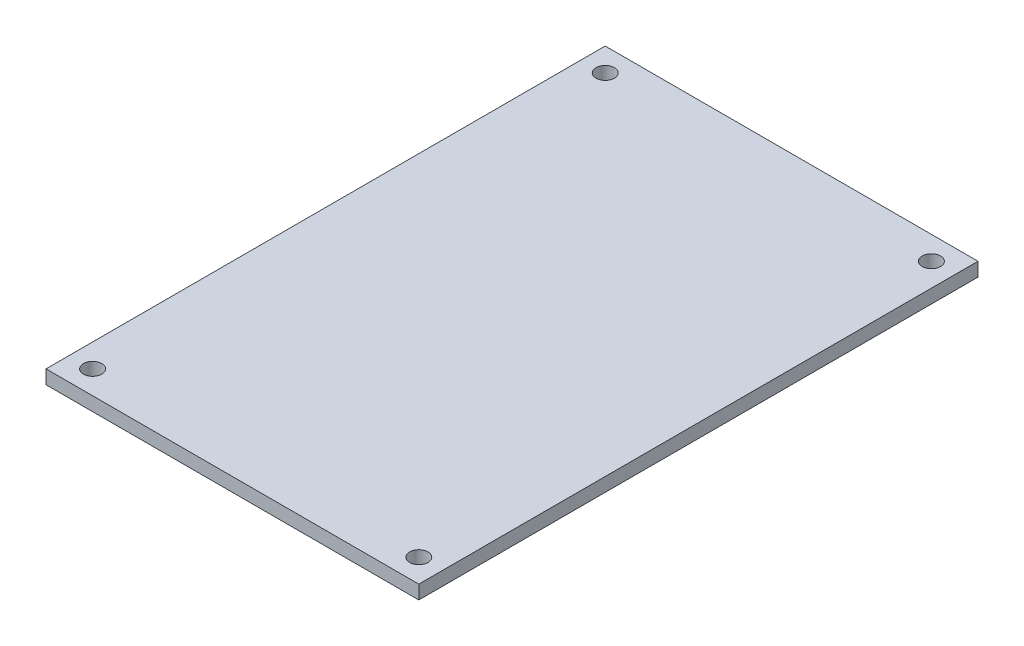
ISO-10303-21;
HEADER;
FILE_DESCRIPTION(('STEP AP214'),'2;1');
FILE_NAME('part.step','',(''),(''),'','','');
FILE_SCHEMA(('AUTOMOTIVE_DESIGN { 1 0 10303 214 1 1 1 1 }'));
ENDSEC;
DATA;
#1=APPLICATION_CONTEXT('core data for automotive mechanical design processes');
#2=APPLICATION_PROTOCOL_DEFINITION('international standard','automotive_design',2000,#1);
#3=PRODUCT_CONTEXT('',#1,'mechanical');
#4=PRODUCT('Part','Part','',(#3));
#5=PRODUCT_RELATED_PRODUCT_CATEGORY('part','',(#4));
#6=PRODUCT_DEFINITION_FORMATION('','',#4);
#7=PRODUCT_DEFINITION_CONTEXT('part definition',#1,'design');
#8=PRODUCT_DEFINITION('design','',#6,#7);
#9=PRODUCT_DEFINITION_SHAPE('','',#8);
#10=(LENGTH_UNIT() NAMED_UNIT(*) SI_UNIT(.MILLI.,.METRE.));
#11=(NAMED_UNIT(*) PLANE_ANGLE_UNIT() SI_UNIT($,.RADIAN.));
#12=(NAMED_UNIT(*) SI_UNIT($,.STERADIAN.) SOLID_ANGLE_UNIT());
#13=UNCERTAINTY_MEASURE_WITH_UNIT(LENGTH_MEASURE(1.E-05),#10,'distance_accuracy_value','');
#14=(GEOMETRIC_REPRESENTATION_CONTEXT(3) GLOBAL_UNCERTAINTY_ASSIGNED_CONTEXT((#13)) GLOBAL_UNIT_ASSIGNED_CONTEXT((#10,
#11,#12)) REPRESENTATION_CONTEXT('',''));
#15=CARTESIAN_POINT('',(0.,0.,0.));
#16=DIRECTION('',(0.,0.,1.));
#17=DIRECTION('',(1.,0.,0.));
#18=AXIS2_PLACEMENT_3D('',#15,#16,#17);
#19=CARTESIAN_POINT('',(0.,0.,0.));
#20=DIRECTION('',(0.,1.,0.));
#21=DIRECTION('',(0.,0.,1.));
#22=AXIS2_PLACEMENT_3D('',#19,#20,#21);
#23=PLANE('',#22);
#24=CARTESIAN_POINT('',(38.1,0.,-50.8));
#25=DIRECTION('',(0.,1.,0.));
#26=DIRECTION('',(0.,0.,1.));
#27=AXIS2_PLACEMENT_3D('',#24,#25,#26);
#28=CIRCLE('',#27,0.499999999999999);
#29=CARTESIAN_POINT('',(38.1,0.,-50.3));
#30=VERTEX_POINT('',#29);
#31=EDGE_CURVE('E207',#30,#30,#28,.T.);
#32=ORIENTED_EDGE('',*,*,#31,.T.);
#33=EDGE_LOOP('',(#32));
#34=FACE_BOUND('',#33,.T.);
#35=CARTESIAN_POINT('',(2.54,0.,-50.8));
#36=DIRECTION('',(0.,1.,0.));
#37=DIRECTION('',(0.,0.,1.));
#38=AXIS2_PLACEMENT_3D('',#35,#36,#37);
#39=CIRCLE('',#38,0.5);
#40=CARTESIAN_POINT('',(2.54,0.,-50.3));
#41=VERTEX_POINT('',#40);
#42=EDGE_CURVE('E130',#41,#41,#39,.F.);
#43=ORIENTED_EDGE('',*,*,#42,.F.);
#44=EDGE_LOOP('',(#43));
#45=FACE_BOUND('',#44,.T.);
#46=CARTESIAN_POINT('',(38.1,0.,-58.42));
#47=DIRECTION('',(0.,1.,0.));
#48=DIRECTION('',(0.,0.,1.));
#49=AXIS2_PLACEMENT_3D('',#46,#47,#48);
#50=CIRCLE('',#49,0.999999999999998);
#51=CARTESIAN_POINT('',(38.1,0.,-57.42));
#52=VERTEX_POINT('',#51);
#53=EDGE_CURVE('E97',#52,#52,#50,.T.);
#54=ORIENTED_EDGE('',*,*,#53,.T.);
#55=EDGE_LOOP('',(#54));
#56=FACE_BOUND('',#55,.T.);
#57=CARTESIAN_POINT('',(38.1,0.,-2.54));
#58=DIRECTION('',(0.,1.,0.));
#59=DIRECTION('',(0.,0.,1.));
#60=AXIS2_PLACEMENT_3D('',#57,#58,#59);
#61=CIRCLE('',#60,0.999999999999998);
#62=CARTESIAN_POINT('',(38.1,0.,-1.54));
#63=VERTEX_POINT('',#62);
#64=EDGE_CURVE('E100',#63,#63,#61,.F.);
#65=ORIENTED_EDGE('',*,*,#64,.F.);
#66=EDGE_LOOP('',(#65));
#67=FACE_BOUND('',#66,.T.);
#68=CARTESIAN_POINT('',(2.54,0.,-58.42));
#69=DIRECTION('',(0.,1.,0.));
#70=DIRECTION('',(0.,0.,1.));
#71=AXIS2_PLACEMENT_3D('',#68,#69,#70);
#72=CIRCLE('',#71,0.999999999999999);
#73=CARTESIAN_POINT('',(2.54,0.,-57.42));
#74=VERTEX_POINT('',#73);
#75=EDGE_CURVE('E104',#74,#74,#72,.F.);
#76=ORIENTED_EDGE('',*,*,#75,.F.);
#77=EDGE_LOOP('',(#76));
#78=FACE_BOUND('',#77,.T.);
#79=CARTESIAN_POINT('',(2.54,0.,-2.54));
#80=DIRECTION('',(0.,1.,0.));
#81=DIRECTION('',(0.,0.,1.));
#82=AXIS2_PLACEMENT_3D('',#79,#80,#81);
#83=CIRCLE('',#82,0.999999999999998);
#84=CARTESIAN_POINT('',(2.54,0.,-1.54));
#85=VERTEX_POINT('',#84);
#86=EDGE_CURVE('E107',#85,#85,#83,.T.);
#87=ORIENTED_EDGE('',*,*,#86,.T.);
#88=EDGE_LOOP('',(#87));
#89=FACE_BOUND('',#88,.T.);
#90=DIRECTION('',(1.,0.,0.));
#91=VECTOR('',#90,1.);
#92=CARTESIAN_POINT('',(0.,0.,0.));
#93=LINE('',#92,#91);
#94=CARTESIAN_POINT('',(0.,0.,0.));
#95=VERTEX_POINT('',#94);
#96=CARTESIAN_POINT('',(40.64,0.,0.));
#97=VERTEX_POINT('',#96);
#98=EDGE_CURVE('E110',#95,#97,#93,.T.);
#99=ORIENTED_EDGE('',*,*,#98,.F.);
#100=DIRECTION('',(0.,0.,-1.));
#101=VECTOR('',#100,1.);
#102=CARTESIAN_POINT('',(0.,0.,0.));
#103=LINE('',#102,#101);
#104=CARTESIAN_POINT('',(0.,0.,-60.96));
#105=VERTEX_POINT('',#104);
#106=EDGE_CURVE('E115',#95,#105,#103,.T.);
#107=ORIENTED_EDGE('',*,*,#106,.T.);
#108=DIRECTION('',(1.,0.,0.));
#109=VECTOR('',#108,1.);
#110=CARTESIAN_POINT('',(0.,0.,-60.96));
#111=LINE('',#110,#109);
#112=CARTESIAN_POINT('',(40.64,0.,-60.96));
#113=VERTEX_POINT('',#112);
#114=EDGE_CURVE('E113',#105,#113,#111,.T.);
#115=ORIENTED_EDGE('',*,*,#114,.T.);
#116=DIRECTION('',(0.,0.,-1.));
#117=VECTOR('',#116,1.);
#118=CARTESIAN_POINT('',(40.64,0.,0.));
#119=LINE('',#118,#117);
#120=EDGE_CURVE('E88',#97,#113,#119,.T.);
#121=ORIENTED_EDGE('',*,*,#120,.F.);
#122=EDGE_LOOP('',(#99,#107,#115,#121));
#123=FACE_BOUND('',#122,.T.);
#124=CARTESIAN_POINT('',(38.1,0.,-10.16));
#125=DIRECTION('',(0.,1.,0.));
#126=DIRECTION('',(0.,0.,1.));
#127=AXIS2_PLACEMENT_3D('',#124,#125,#126);
#128=CIRCLE('',#127,0.499999999999999);
#129=CARTESIAN_POINT('',(38.1,0.,-9.66));
#130=VERTEX_POINT('',#129);
#131=EDGE_CURVE('E194',#130,#130,#128,.F.);
#132=ORIENTED_EDGE('',*,*,#131,.F.);
#133=EDGE_LOOP('',(#132));
#134=FACE_BOUND('',#133,.T.);
#135=CARTESIAN_POINT('',(2.54,0.,-10.16));
#136=DIRECTION('',(0.,1.,0.));
#137=DIRECTION('',(0.,0.,1.));
#138=AXIS2_PLACEMENT_3D('',#135,#136,#137);
#139=CIRCLE('',#138,0.5);
#140=CARTESIAN_POINT('',(2.54,0.,-9.66));
#141=VERTEX_POINT('',#140);
#142=EDGE_CURVE('E197',#141,#141,#139,.T.);
#143=ORIENTED_EDGE('',*,*,#142,.T.);
#144=EDGE_LOOP('',(#143));
#145=FACE_BOUND('',#144,.T.);
#146=ADVANCED_FACE('F33',(#34,#45,#56,#67,#78,#89,#123,#134,#145),#23,.F.);
#147=CARTESIAN_POINT('',(0.,1.5,0.));
#148=DIRECTION('',(0.,0.,-1.));
#149=DIRECTION('',(-1.,0.,0.));
#150=AXIS2_PLACEMENT_3D('',#147,#148,#149);
#151=PLANE('',#150);
#152=ORIENTED_EDGE('',*,*,#98,.T.);
#153=DIRECTION('',(0.,-1.,0.));
#154=VECTOR('',#153,1.);
#155=CARTESIAN_POINT('',(40.64,1.5,0.));
#156=LINE('',#155,#154);
#157=CARTESIAN_POINT('',(40.64,1.5,0.));
#158=VERTEX_POINT('',#157);
#159=EDGE_CURVE('E11',#158,#97,#156,.T.);
#160=ORIENTED_EDGE('',*,*,#159,.F.);
#161=DIRECTION('',(1.,0.,0.));
#162=VECTOR('',#161,1.);
#163=CARTESIAN_POINT('',(0.,1.5,0.));
#164=LINE('',#163,#162);
#165=CARTESIAN_POINT('',(0.,1.5,0.));
#166=VERTEX_POINT('',#165);
#167=EDGE_CURVE('E83',#166,#158,#164,.T.);
#168=ORIENTED_EDGE('',*,*,#167,.F.);
#169=DIRECTION('',(0.,-1.,0.));
#170=VECTOR('',#169,1.);
#171=CARTESIAN_POINT('',(0.,1.5,0.));
#172=LINE('',#171,#170);
#173=EDGE_CURVE('E50',#166,#95,#172,.T.);
#174=ORIENTED_EDGE('',*,*,#173,.T.);
#175=EDGE_LOOP('',(#152,#160,#168,#174));
#176=FACE_BOUND('',#175,.T.);
#177=ADVANCED_FACE('F158',(#176),#151,.F.);
#178=CARTESIAN_POINT('',(40.64,1.5,0.));
#179=DIRECTION('',(-1.,0.,0.));
#180=DIRECTION('',(0.,0.,1.));
#181=AXIS2_PLACEMENT_3D('',#178,#179,#180);
#182=PLANE('',#181);
#183=ORIENTED_EDGE('',*,*,#120,.T.);
#184=DIRECTION('',(0.,-1.,0.));
#185=VECTOR('',#184,1.);
#186=CARTESIAN_POINT('',(40.64,1.5,-60.96));
#187=LINE('',#186,#185);
#188=CARTESIAN_POINT('',(40.64,1.5,-60.96));
#189=VERTEX_POINT('',#188);
#190=EDGE_CURVE('E42',#189,#113,#187,.T.);
#191=ORIENTED_EDGE('',*,*,#190,.F.);
#192=DIRECTION('',(0.,0.,-1.));
#193=VECTOR('',#192,1.);
#194=CARTESIAN_POINT('',(40.64,1.5,0.));
#195=LINE('',#194,#193);
#196=EDGE_CURVE('E75',#158,#189,#195,.T.);
#197=ORIENTED_EDGE('',*,*,#196,.F.);
#198=ORIENTED_EDGE('',*,*,#159,.T.);
#199=EDGE_LOOP('',(#183,#191,#197,#198));
#200=FACE_BOUND('',#199,.T.);
#201=ADVANCED_FACE('F87',(#200),#182,.F.);
#202=CARTESIAN_POINT('',(0.,1.5,-60.96));
#203=DIRECTION('',(0.,0.,-1.));
#204=DIRECTION('',(-1.,0.,0.));
#205=AXIS2_PLACEMENT_3D('',#202,#203,#204);
#206=PLANE('',#205);
#207=ORIENTED_EDGE('',*,*,#114,.F.);
#208=DIRECTION('',(0.,-1.,0.));
#209=VECTOR('',#208,1.);
#210=CARTESIAN_POINT('',(0.,1.5,-60.96));
#211=LINE('',#210,#209);
#212=CARTESIAN_POINT('',(0.,1.5,-60.96));
#213=VERTEX_POINT('',#212);
#214=EDGE_CURVE('E64',#213,#105,#211,.T.);
#215=ORIENTED_EDGE('',*,*,#214,.F.);
#216=DIRECTION('',(1.,0.,0.));
#217=VECTOR('',#216,1.);
#218=CARTESIAN_POINT('',(0.,1.5,-60.96));
#219=LINE('',#218,#217);
#220=EDGE_CURVE('E82',#213,#189,#219,.T.);
#221=ORIENTED_EDGE('',*,*,#220,.T.);
#222=ORIENTED_EDGE('',*,*,#190,.T.);
#223=EDGE_LOOP('',(#207,#215,#221,#222));
#224=FACE_BOUND('',#223,.T.);
#225=ADVANCED_FACE('F91',(#224),#206,.T.);
#226=CARTESIAN_POINT('',(2.54,1.5,-2.54));
#227=DIRECTION('',(0.,-1.,0.));
#228=DIRECTION('',(0.,0.,-1.));
#229=AXIS2_PLACEMENT_3D('',#226,#227,#228);
#230=CYLINDRICAL_SURFACE('',#229,0.999999999999998);
#231=CARTESIAN_POINT('',(2.54,1.5,-2.54));
#232=DIRECTION('',(0.,1.,0.));
#233=DIRECTION('',(0.,0.,1.));
#234=AXIS2_PLACEMENT_3D('',#231,#232,#233);
#235=CIRCLE('',#234,0.999999999999998);
#236=CARTESIAN_POINT('',(2.54,1.5,-1.54));
#237=VERTEX_POINT('',#236);
#238=EDGE_CURVE('E135',#237,#237,#235,.T.);
#239=ORIENTED_EDGE('',*,*,#238,.T.);
#240=EDGE_LOOP('',(#239));
#241=FACE_BOUND('',#240,.T.);
#242=ORIENTED_EDGE('',*,*,#86,.F.);
#243=EDGE_LOOP('',(#242));
#244=FACE_BOUND('',#243,.T.);
#245=ADVANCED_FACE('F139',(#241,#244),#230,.F.);
#246=CARTESIAN_POINT('',(2.54,1.5,-58.42));
#247=DIRECTION('',(0.,-1.,0.));
#248=DIRECTION('',(0.,0.,-1.));
#249=AXIS2_PLACEMENT_3D('',#246,#247,#248);
#250=CYLINDRICAL_SURFACE('',#249,0.999999999999999);
#251=CARTESIAN_POINT('',(2.54,1.5,-58.42));
#252=DIRECTION('',(0.,1.,0.));
#253=DIRECTION('',(0.,0.,1.));
#254=AXIS2_PLACEMENT_3D('',#251,#252,#253);
#255=CIRCLE('',#254,0.999999999999999);
#256=CARTESIAN_POINT('',(2.54,1.5,-57.42));
#257=VERTEX_POINT('',#256);
#258=EDGE_CURVE('E127',#257,#257,#255,.F.);
#259=ORIENTED_EDGE('',*,*,#258,.F.);
#260=EDGE_LOOP('',(#259));
#261=FACE_BOUND('',#260,.T.);
#262=ORIENTED_EDGE('',*,*,#75,.T.);
#263=EDGE_LOOP('',(#262));
#264=FACE_BOUND('',#263,.T.);
#265=ADVANCED_FACE('F173',(#261,#264),#250,.F.);
#266=CARTESIAN_POINT('',(38.1,1.5,-2.54));
#267=DIRECTION('',(0.,-1.,0.));
#268=DIRECTION('',(0.,0.,-1.));
#269=AXIS2_PLACEMENT_3D('',#266,#267,#268);
#270=CYLINDRICAL_SURFACE('',#269,0.999999999999998);
#271=CARTESIAN_POINT('',(38.1,1.5,-2.54));
#272=DIRECTION('',(0.,1.,0.));
#273=DIRECTION('',(0.,0.,1.));
#274=AXIS2_PLACEMENT_3D('',#271,#272,#273);
#275=CIRCLE('',#274,0.999999999999998);
#276=CARTESIAN_POINT('',(38.1,1.5,-1.54));
#277=VERTEX_POINT('',#276);
#278=EDGE_CURVE('E122',#277,#277,#275,.F.);
#279=ORIENTED_EDGE('',*,*,#278,.F.);
#280=EDGE_LOOP('',(#279));
#281=FACE_BOUND('',#280,.T.);
#282=ORIENTED_EDGE('',*,*,#64,.T.);
#283=EDGE_LOOP('',(#282));
#284=FACE_BOUND('',#283,.T.);
#285=ADVANCED_FACE('F175',(#281,#284),#270,.F.);
#286=CARTESIAN_POINT('',(38.1,1.5,-58.42));
#287=DIRECTION('',(0.,-1.,0.));
#288=DIRECTION('',(0.,0.,-1.));
#289=AXIS2_PLACEMENT_3D('',#286,#287,#288);
#290=CYLINDRICAL_SURFACE('',#289,0.999999999999998);
#291=CARTESIAN_POINT('',(38.1,1.5,-58.42));
#292=DIRECTION('',(0.,1.,0.));
#293=DIRECTION('',(0.,0.,1.));
#294=AXIS2_PLACEMENT_3D('',#291,#292,#293);
#295=CIRCLE('',#294,0.999999999999998);
#296=CARTESIAN_POINT('',(38.1,1.5,-57.42));
#297=VERTEX_POINT('',#296);
#298=EDGE_CURVE('E118',#297,#297,#295,.T.);
#299=ORIENTED_EDGE('',*,*,#298,.T.);
#300=EDGE_LOOP('',(#299));
#301=FACE_BOUND('',#300,.T.);
#302=ORIENTED_EDGE('',*,*,#53,.F.);
#303=EDGE_LOOP('',(#302));
#304=FACE_BOUND('',#303,.T.);
#305=ADVANCED_FACE('F35',(#301,#304),#290,.F.);
#306=CARTESIAN_POINT('',(0.,1.5,0.));
#307=DIRECTION('',(-1.,0.,0.));
#308=DIRECTION('',(0.,0.,1.));
#309=AXIS2_PLACEMENT_3D('',#306,#307,#308);
#310=PLANE('',#309);
#311=ORIENTED_EDGE('',*,*,#106,.F.);
#312=ORIENTED_EDGE('',*,*,#173,.F.);
#313=DIRECTION('',(0.,0.,-1.));
#314=VECTOR('',#313,1.);
#315=CARTESIAN_POINT('',(0.,1.5,0.));
#316=LINE('',#315,#314);
#317=EDGE_CURVE('E92',#166,#213,#316,.T.);
#318=ORIENTED_EDGE('',*,*,#317,.T.);
#319=ORIENTED_EDGE('',*,*,#214,.T.);
#320=EDGE_LOOP('',(#311,#312,#318,#319));
#321=FACE_BOUND('',#320,.T.);
#322=ADVANCED_FACE('F144',(#321),#310,.T.);
#323=CARTESIAN_POINT('',(0.,1.5,0.));
#324=DIRECTION('',(0.,1.,0.));
#325=DIRECTION('',(0.,0.,1.));
#326=AXIS2_PLACEMENT_3D('',#323,#324,#325);
#327=PLANE('',#326);
#328=ORIENTED_EDGE('',*,*,#298,.F.);
#329=EDGE_LOOP('',(#328));
#330=FACE_BOUND('',#329,.T.);
#331=ORIENTED_EDGE('',*,*,#278,.T.);
#332=EDGE_LOOP('',(#331));
#333=FACE_BOUND('',#332,.T.);
#334=ORIENTED_EDGE('',*,*,#258,.T.);
#335=EDGE_LOOP('',(#334));
#336=FACE_BOUND('',#335,.T.);
#337=ORIENTED_EDGE('',*,*,#238,.F.);
#338=EDGE_LOOP('',(#337));
#339=FACE_BOUND('',#338,.T.);
#340=ORIENTED_EDGE('',*,*,#167,.T.);
#341=ORIENTED_EDGE('',*,*,#196,.T.);
#342=ORIENTED_EDGE('',*,*,#220,.F.);
#343=ORIENTED_EDGE('',*,*,#317,.F.);
#344=EDGE_LOOP('',(#340,#341,#342,#343));
#345=FACE_BOUND('',#344,.T.);
#346=ADVANCED_FACE('F79',(#330,#333,#336,#339,#345),#327,.T.);
#347=CARTESIAN_POINT('',(2.54,0.75,-50.8));
#348=DIRECTION('',(0.,-1.,0.));
#349=DIRECTION('',(0.,0.,-1.));
#350=AXIS2_PLACEMENT_3D('',#347,#348,#349);
#351=CYLINDRICAL_SURFACE('',#350,0.5);
#352=CARTESIAN_POINT('',(2.54,0.75,-50.8));
#353=DIRECTION('',(0.,1.,0.));
#354=DIRECTION('',(0.,0.,1.));
#355=AXIS2_PLACEMENT_3D('',#352,#353,#354);
#356=CIRCLE('',#355,0.5);
#357=CARTESIAN_POINT('',(2.54,0.75,-50.3));
#358=VERTEX_POINT('',#357);
#359=EDGE_CURVE('E101',#358,#358,#356,.F.);
#360=ORIENTED_EDGE('',*,*,#359,.F.);
#361=EDGE_LOOP('',(#360));
#362=FACE_BOUND('',#361,.T.);
#363=ORIENTED_EDGE('',*,*,#42,.T.);
#364=EDGE_LOOP('',(#363));
#365=FACE_BOUND('',#364,.T.);
#366=ADVANCED_FACE('F143',(#362,#365),#351,.F.);
#367=CARTESIAN_POINT('',(0.,0.75,0.));
#368=DIRECTION('',(0.,1.,0.));
#369=DIRECTION('',(0.,0.,1.));
#370=AXIS2_PLACEMENT_3D('',#367,#368,#369);
#371=PLANE('',#370);
#372=ORIENTED_EDGE('',*,*,#359,.T.);
#373=EDGE_LOOP('',(#372));
#374=FACE_BOUND('',#373,.T.);
#375=ADVANCED_FACE('F151',(#374),#371,.F.);
#376=CARTESIAN_POINT('',(38.1,0.75,-50.8));
#377=DIRECTION('',(0.,-1.,0.));
#378=DIRECTION('',(0.,0.,-1.));
#379=AXIS2_PLACEMENT_3D('',#376,#377,#378);
#380=CYLINDRICAL_SURFACE('',#379,0.499999999999999);
#381=CARTESIAN_POINT('',(38.1,0.75,-50.8));
#382=DIRECTION('',(0.,1.,0.));
#383=DIRECTION('',(0.,0.,1.));
#384=AXIS2_PLACEMENT_3D('',#381,#382,#383);
#385=CIRCLE('',#384,0.499999999999999);
#386=CARTESIAN_POINT('',(38.1,0.75,-50.3));
#387=VERTEX_POINT('',#386);
#388=EDGE_CURVE('E209',#387,#387,#385,.T.);
#389=ORIENTED_EDGE('',*,*,#388,.T.);
#390=EDGE_LOOP('',(#389));
#391=FACE_BOUND('',#390,.T.);
#392=ORIENTED_EDGE('',*,*,#31,.F.);
#393=EDGE_LOOP('',(#392));
#394=FACE_BOUND('',#393,.T.);
#395=ADVANCED_FACE('F222',(#391,#394),#380,.F.);
#396=CARTESIAN_POINT('',(0.,0.75,0.));
#397=DIRECTION('',(0.,1.,0.));
#398=DIRECTION('',(0.,0.,1.));
#399=AXIS2_PLACEMENT_3D('',#396,#397,#398);
#400=PLANE('',#399);
#401=ORIENTED_EDGE('',*,*,#388,.F.);
#402=EDGE_LOOP('',(#401));
#403=FACE_BOUND('',#402,.T.);
#404=ADVANCED_FACE('F227',(#403),#400,.F.);
#405=CARTESIAN_POINT('',(38.1,0.75,-10.16));
#406=DIRECTION('',(0.,-1.,0.));
#407=DIRECTION('',(0.,0.,-1.));
#408=AXIS2_PLACEMENT_3D('',#405,#406,#407);
#409=CYLINDRICAL_SURFACE('',#408,0.499999999999999);
#410=CARTESIAN_POINT('',(38.1,0.75,-10.16));
#411=DIRECTION('',(0.,1.,0.));
#412=DIRECTION('',(0.,0.,1.));
#413=AXIS2_PLACEMENT_3D('',#410,#411,#412);
#414=CIRCLE('',#413,0.499999999999999);
#415=CARTESIAN_POINT('',(38.1,0.75,-9.66));
#416=VERTEX_POINT('',#415);
#417=EDGE_CURVE('E204',#416,#416,#414,.F.);
#418=ORIENTED_EDGE('',*,*,#417,.F.);
#419=EDGE_LOOP('',(#418));
#420=FACE_BOUND('',#419,.T.);
#421=ORIENTED_EDGE('',*,*,#131,.T.);
#422=EDGE_LOOP('',(#421));
#423=FACE_BOUND('',#422,.T.);
#424=ADVANCED_FACE('F233',(#420,#423),#409,.F.);
#425=CARTESIAN_POINT('',(0.,0.75,0.));
#426=DIRECTION('',(0.,1.,0.));
#427=DIRECTION('',(0.,0.,1.));
#428=AXIS2_PLACEMENT_3D('',#425,#426,#427);
#429=PLANE('',#428);
#430=ORIENTED_EDGE('',*,*,#417,.T.);
#431=EDGE_LOOP('',(#430));
#432=FACE_BOUND('',#431,.T.);
#433=ADVANCED_FACE('F237',(#432),#429,.F.);
#434=CARTESIAN_POINT('',(2.54,0.75,-10.16));
#435=DIRECTION('',(0.,-1.,0.));
#436=DIRECTION('',(0.,0.,-1.));
#437=AXIS2_PLACEMENT_3D('',#434,#435,#436);
#438=CYLINDRICAL_SURFACE('',#437,0.5);
#439=CARTESIAN_POINT('',(2.54,0.75,-10.16));
#440=DIRECTION('',(0.,1.,0.));
#441=DIRECTION('',(0.,0.,1.));
#442=AXIS2_PLACEMENT_3D('',#439,#440,#441);
#443=CIRCLE('',#442,0.5);
#444=CARTESIAN_POINT('',(2.54,0.75,-9.66));
#445=VERTEX_POINT('',#444);
#446=EDGE_CURVE('E199',#445,#445,#443,.T.);
#447=ORIENTED_EDGE('',*,*,#446,.T.);
#448=EDGE_LOOP('',(#447));
#449=FACE_BOUND('',#448,.T.);
#450=ORIENTED_EDGE('',*,*,#142,.F.);
#451=EDGE_LOOP('',(#450));
#452=FACE_BOUND('',#451,.T.);
#453=ADVANCED_FACE('F241',(#449,#452),#438,.F.);
#454=CARTESIAN_POINT('',(0.,0.75,0.));
#455=DIRECTION('',(0.,1.,0.));
#456=DIRECTION('',(0.,0.,1.));
#457=AXIS2_PLACEMENT_3D('',#454,#455,#456);
#458=PLANE('',#457);
#459=ORIENTED_EDGE('',*,*,#446,.F.);
#460=EDGE_LOOP('',(#459));
#461=FACE_BOUND('',#460,.T.);
#462=ADVANCED_FACE('F245',(#461),#458,.F.);
#463=CLOSED_SHELL('',(#146,#177,#201,#225,#245,#265,#285,#305,#322,#346,#366,#375,#395,#404,
#424,#433,#453,#462));
#464=MANIFOLD_SOLID_BREP('B2',#463);
#465=ADVANCED_BREP_SHAPE_REPRESENTATION('',(#18,#464),#14);
#466=SHAPE_DEFINITION_REPRESENTATION(#9,#465);
ENDSEC;
END-ISO-10303-21;
